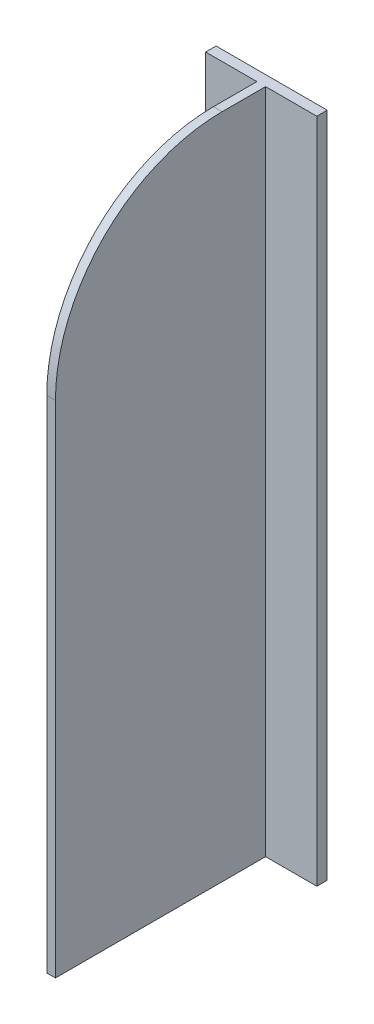
ISO-10303-21;
HEADER;
FILE_DESCRIPTION(('STEP AP214'),'2;1');
FILE_NAME('part.step','',(''),(''),'','','');
FILE_SCHEMA(('AUTOMOTIVE_DESIGN { 1 0 10303 214 1 1 1 1 }'));
ENDSEC;
DATA;
#1=APPLICATION_CONTEXT('core data for automotive mechanical design processes');
#2=APPLICATION_PROTOCOL_DEFINITION('international standard','automotive_design',2000,#1);
#3=PRODUCT_CONTEXT('',#1,'mechanical');
#4=PRODUCT('Part','Part','',(#3));
#5=PRODUCT_RELATED_PRODUCT_CATEGORY('part','',(#4));
#6=PRODUCT_DEFINITION_FORMATION('','',#4);
#7=PRODUCT_DEFINITION_CONTEXT('part definition',#1,'design');
#8=PRODUCT_DEFINITION('design','',#6,#7);
#9=PRODUCT_DEFINITION_SHAPE('','',#8);
#10=(LENGTH_UNIT() NAMED_UNIT(*) SI_UNIT(.MILLI.,.METRE.));
#11=(NAMED_UNIT(*) PLANE_ANGLE_UNIT() SI_UNIT($,.RADIAN.));
#12=(NAMED_UNIT(*) SI_UNIT($,.STERADIAN.) SOLID_ANGLE_UNIT());
#13=UNCERTAINTY_MEASURE_WITH_UNIT(LENGTH_MEASURE(1.E-05),#10,'distance_accuracy_value','');
#14=(GEOMETRIC_REPRESENTATION_CONTEXT(3) GLOBAL_UNCERTAINTY_ASSIGNED_CONTEXT((#13)) GLOBAL_UNIT_ASSIGNED_CONTEXT((#10,
#11,#12)) REPRESENTATION_CONTEXT('',''));
#15=CARTESIAN_POINT('',(0.,0.,0.));
#16=DIRECTION('',(0.,0.,1.));
#17=DIRECTION('',(1.,0.,0.));
#18=AXIS2_PLACEMENT_3D('',#15,#16,#17);
#19=CARTESIAN_POINT('',(50.8,304.8,9.525));
#20=DIRECTION('',(-1.,0.,0.));
#21=DIRECTION('',(0.,0.,1.));
#22=AXIS2_PLACEMENT_3D('',#19,#20,#21);
#23=PLANE('',#22);
#24=DIRECTION('',(0.,0.,-1.));
#25=VECTOR('',#24,1.);
#26=CARTESIAN_POINT('',(50.8,-304.8,9.525));
#27=LINE('',#26,#25);
#28=CARTESIAN_POINT('',(50.8,-304.8,9.525));
#29=VERTEX_POINT('',#28);
#30=CARTESIAN_POINT('',(50.8,-304.8,0.));
#31=VERTEX_POINT('',#30);
#32=EDGE_CURVE('E128',#29,#31,#27,.T.);
#33=ORIENTED_EDGE('',*,*,#32,.T.);
#34=DIRECTION('',(0.,-1.,0.));
#35=VECTOR('',#34,1.);
#36=CARTESIAN_POINT('',(50.8,304.8,0.));
#37=LINE('',#36,#35);
#38=CARTESIAN_POINT('',(50.8,304.8,0.));
#39=VERTEX_POINT('',#38);
#40=EDGE_CURVE('E108',#39,#31,#37,.T.);
#41=ORIENTED_EDGE('',*,*,#40,.F.);
#42=DIRECTION('',(0.,0.,-1.));
#43=VECTOR('',#42,1.);
#44=CARTESIAN_POINT('',(50.8,304.8,9.525));
#45=LINE('',#44,#43);
#46=CARTESIAN_POINT('',(50.8,304.8,9.525));
#47=VERTEX_POINT('',#46);
#48=EDGE_CURVE('E115',#47,#39,#45,.T.);
#49=ORIENTED_EDGE('',*,*,#48,.F.);
#50=DIRECTION('',(0.,-1.,0.));
#51=VECTOR('',#50,1.);
#52=CARTESIAN_POINT('',(50.8,304.8,9.525));
#53=LINE('',#52,#51);
#54=EDGE_CURVE('E149',#47,#29,#53,.T.);
#55=ORIENTED_EDGE('',*,*,#54,.T.);
#56=EDGE_LOOP('',(#33,#41,#49,#55));
#57=FACE_BOUND('',#56,.T.);
#58=ADVANCED_FACE('F35',(#57),#23,.F.);
#59=CARTESIAN_POINT('',(50.8,304.8,0.));
#60=DIRECTION('',(0.,0.,1.));
#61=DIRECTION('',(1.,0.,0.));
#62=AXIS2_PLACEMENT_3D('',#59,#60,#61);
#63=PLANE('',#62);
#64=DIRECTION('',(-1.,0.,0.));
#65=VECTOR('',#64,1.);
#66=CARTESIAN_POINT('',(50.8,-304.8,0.));
#67=LINE('',#66,#65);
#68=CARTESIAN_POINT('',(-50.8,-304.8,0.));
#69=VERTEX_POINT('',#68);
#70=EDGE_CURVE('E164',#31,#69,#67,.T.);
#71=ORIENTED_EDGE('',*,*,#70,.T.);
#72=DIRECTION('',(0.,-1.,0.));
#73=VECTOR('',#72,1.);
#74=CARTESIAN_POINT('',(-50.8,304.8,0.));
#75=LINE('',#74,#73);
#76=CARTESIAN_POINT('',(-50.8,304.8,0.));
#77=VERTEX_POINT('',#76);
#78=EDGE_CURVE('E111',#77,#69,#75,.T.);
#79=ORIENTED_EDGE('',*,*,#78,.F.);
#80=DIRECTION('',(-1.,0.,0.));
#81=VECTOR('',#80,1.);
#82=CARTESIAN_POINT('',(50.8,304.8,0.));
#83=LINE('',#82,#81);
#84=EDGE_CURVE('E104',#39,#77,#83,.T.);
#85=ORIENTED_EDGE('',*,*,#84,.F.);
#86=ORIENTED_EDGE('',*,*,#40,.T.);
#87=EDGE_LOOP('',(#71,#79,#85,#86));
#88=FACE_BOUND('',#87,.T.);
#89=ADVANCED_FACE('F106',(#88),#63,.F.);
#90=CARTESIAN_POINT('',(-50.8,304.8,0.));
#91=DIRECTION('',(1.,0.,0.));
#92=DIRECTION('',(0.,0.,-1.));
#93=AXIS2_PLACEMENT_3D('',#90,#91,#92);
#94=PLANE('',#93);
#95=DIRECTION('',(0.,0.,1.));
#96=VECTOR('',#95,1.);
#97=CARTESIAN_POINT('',(-50.8,-304.8,0.));
#98=LINE('',#97,#96);
#99=CARTESIAN_POINT('',(-50.8,-304.8,9.525));
#100=VERTEX_POINT('',#99);
#101=EDGE_CURVE('E162',#69,#100,#98,.T.);
#102=ORIENTED_EDGE('',*,*,#101,.T.);
#103=DIRECTION('',(0.,-1.,0.));
#104=VECTOR('',#103,1.);
#105=CARTESIAN_POINT('',(-50.8,304.8,9.525));
#106=LINE('',#105,#104);
#107=CARTESIAN_POINT('',(-50.8,304.8,9.525));
#108=VERTEX_POINT('',#107);
#109=EDGE_CURVE('E133',#108,#100,#106,.T.);
#110=ORIENTED_EDGE('',*,*,#109,.F.);
#111=DIRECTION('',(0.,0.,1.));
#112=VECTOR('',#111,1.);
#113=CARTESIAN_POINT('',(-50.8,304.8,0.));
#114=LINE('',#113,#112);
#115=EDGE_CURVE('E114',#77,#108,#114,.T.);
#116=ORIENTED_EDGE('',*,*,#115,.F.);
#117=ORIENTED_EDGE('',*,*,#78,.T.);
#118=EDGE_LOOP('',(#102,#110,#116,#117));
#119=FACE_BOUND('',#118,.T.);
#120=ADVANCED_FACE('F178',(#119),#94,.F.);
#121=CARTESIAN_POINT('',(-50.8,304.8,9.525));
#122=DIRECTION('',(0.,0.,-1.));
#123=DIRECTION('',(-1.,0.,0.));
#124=AXIS2_PLACEMENT_3D('',#121,#122,#123);
#125=PLANE('',#124);
#126=DIRECTION('',(1.,0.,0.));
#127=VECTOR('',#126,1.);
#128=CARTESIAN_POINT('',(-50.8,-304.8,9.525));
#129=LINE('',#128,#127);
#130=CARTESIAN_POINT('',(-3.96874999999999,-304.8,9.52500000000001));
#131=VERTEX_POINT('',#130);
#132=EDGE_CURVE('E160',#100,#131,#129,.T.);
#133=ORIENTED_EDGE('',*,*,#132,.T.);
#134=DIRECTION('',(0.,-1.,0.));
#135=VECTOR('',#134,1.);
#136=CARTESIAN_POINT('',(-3.96874999999999,304.8,9.52500000000001));
#137=LINE('',#136,#135);
#138=CARTESIAN_POINT('',(-3.96874999999999,304.8,9.52500000000001));
#139=VERTEX_POINT('',#138);
#140=EDGE_CURVE('E139',#139,#131,#137,.T.);
#141=ORIENTED_EDGE('',*,*,#140,.F.);
#142=DIRECTION('',(1.,0.,0.));
#143=VECTOR('',#142,1.);
#144=CARTESIAN_POINT('',(-50.8,304.8,9.525));
#145=LINE('',#144,#143);
#146=EDGE_CURVE('E172',#108,#139,#145,.T.);
#147=ORIENTED_EDGE('',*,*,#146,.F.);
#148=ORIENTED_EDGE('',*,*,#109,.T.);
#149=EDGE_LOOP('',(#133,#141,#147,#148));
#150=FACE_BOUND('',#149,.T.);
#151=ADVANCED_FACE('F182',(#150),#125,.F.);
#152=CARTESIAN_POINT('',(-3.96874999999999,304.8,9.52500000000001));
#153=DIRECTION('',(1.,0.,0.));
#154=DIRECTION('',(0.,0.,-1.));
#155=AXIS2_PLACEMENT_3D('',#152,#153,#154);
#156=PLANE('',#155);
#157=DIRECTION('',(0.,-1.,0.));
#158=VECTOR('',#157,1.);
#159=CARTESIAN_POINT('',(-3.96875,304.8,201.6125));
#160=LINE('',#159,#158);
#161=CARTESIAN_POINT('',(-3.96875,152.4,201.6125));
#162=VERTEX_POINT('',#161);
#163=CARTESIAN_POINT('',(-3.96875,-304.8,201.6125));
#164=VERTEX_POINT('',#163);
#165=EDGE_CURVE('E142',#162,#164,#160,.T.);
#166=ORIENTED_EDGE('',*,*,#165,.F.);
#167=CARTESIAN_POINT('',(-3.96874999999999,152.4,49.2125));
#168=DIRECTION('',(1.,0.,0.));
#169=DIRECTION('',(0.,0.,-1.));
#170=AXIS2_PLACEMENT_3D('',#167,#168,#169);
#171=CIRCLE('',#170,152.4);
#172=CARTESIAN_POINT('',(-3.96874999999999,304.8,49.2125));
#173=VERTEX_POINT('',#172);
#174=EDGE_CURVE('E11',#162,#173,#171,.F.);
#175=ORIENTED_EDGE('',*,*,#174,.T.);
#176=DIRECTION('',(0.,0.,1.));
#177=VECTOR('',#176,1.);
#178=CARTESIAN_POINT('',(-3.96874999999999,304.8,9.52500000000001));
#179=LINE('',#178,#177);
#180=EDGE_CURVE('E170',#139,#173,#179,.T.);
#181=ORIENTED_EDGE('',*,*,#180,.F.);
#182=ORIENTED_EDGE('',*,*,#140,.T.);
#183=DIRECTION('',(0.,0.,1.));
#184=VECTOR('',#183,1.);
#185=CARTESIAN_POINT('',(-3.96874999999999,-304.8,9.52500000000001));
#186=LINE('',#185,#184);
#187=EDGE_CURVE('E157',#131,#164,#186,.T.);
#188=ORIENTED_EDGE('',*,*,#187,.T.);
#189=EDGE_LOOP('',(#166,#175,#181,#182,#188));
#190=FACE_BOUND('',#189,.T.);
#191=ADVANCED_FACE('F186',(#190),#156,.F.);
#192=CARTESIAN_POINT('',(-3.96875,304.8,201.6125));
#193=DIRECTION('',(0.,0.,-1.));
#194=DIRECTION('',(-1.,0.,0.));
#195=AXIS2_PLACEMENT_3D('',#192,#193,#194);
#196=PLANE('',#195);
#197=DIRECTION('',(0.,-1.,0.));
#198=VECTOR('',#197,1.);
#199=CARTESIAN_POINT('',(3.96875,304.8,201.6125));
#200=LINE('',#199,#198);
#201=CARTESIAN_POINT('',(3.96875,152.4,201.6125));
#202=VERTEX_POINT('',#201);
#203=CARTESIAN_POINT('',(3.96875,-304.8,201.6125));
#204=VERTEX_POINT('',#203);
#205=EDGE_CURVE('E144',#202,#204,#200,.T.);
#206=ORIENTED_EDGE('',*,*,#205,.F.);
#207=DIRECTION('',(1.,0.,0.));
#208=VECTOR('',#207,1.);
#209=CARTESIAN_POINT('',(-3.96875,152.4,201.6125));
#210=LINE('',#209,#208);
#211=EDGE_CURVE('E43',#202,#162,#210,.F.);
#212=ORIENTED_EDGE('',*,*,#211,.T.);
#213=ORIENTED_EDGE('',*,*,#165,.T.);
#214=DIRECTION('',(1.,0.,0.));
#215=VECTOR('',#214,1.);
#216=CARTESIAN_POINT('',(-3.96875,-304.8,201.6125));
#217=LINE('',#216,#215);
#218=EDGE_CURVE('E154',#164,#204,#217,.T.);
#219=ORIENTED_EDGE('',*,*,#218,.T.);
#220=EDGE_LOOP('',(#206,#212,#213,#219));
#221=FACE_BOUND('',#220,.T.);
#222=ADVANCED_FACE('F209',(#221),#196,.F.);
#223=CARTESIAN_POINT('',(3.96875,304.8,201.6125));
#224=DIRECTION('',(-1.,0.,0.));
#225=DIRECTION('',(0.,0.,1.));
#226=AXIS2_PLACEMENT_3D('',#223,#224,#225);
#227=PLANE('',#226);
#228=DIRECTION('',(0.,0.,-1.));
#229=VECTOR('',#228,1.);
#230=CARTESIAN_POINT('',(3.96875,304.8,201.6125));
#231=LINE('',#230,#229);
#232=CARTESIAN_POINT('',(3.96874999999999,304.8,49.2125));
#233=VERTEX_POINT('',#232);
#234=CARTESIAN_POINT('',(3.96874999999999,304.8,9.52500000000001));
#235=VERTEX_POINT('',#234);
#236=EDGE_CURVE('E168',#233,#235,#231,.T.);
#237=ORIENTED_EDGE('',*,*,#236,.F.);
#238=CARTESIAN_POINT('',(3.96874999999999,152.4,49.2125));
#239=DIRECTION('',(-1.,0.,0.));
#240=DIRECTION('',(0.,0.,1.));
#241=AXIS2_PLACEMENT_3D('',#238,#239,#240);
#242=CIRCLE('',#241,152.4);
#243=EDGE_CURVE('E57',#233,#202,#242,.F.);
#244=ORIENTED_EDGE('',*,*,#243,.T.);
#245=ORIENTED_EDGE('',*,*,#205,.T.);
#246=DIRECTION('',(0.,0.,-1.));
#247=VECTOR('',#246,1.);
#248=CARTESIAN_POINT('',(3.96875,-304.8,201.6125));
#249=LINE('',#248,#247);
#250=CARTESIAN_POINT('',(3.96874999999999,-304.8,9.52500000000001));
#251=VERTEX_POINT('',#250);
#252=EDGE_CURVE('E152',#204,#251,#249,.T.);
#253=ORIENTED_EDGE('',*,*,#252,.T.);
#254=DIRECTION('',(0.,-1.,0.));
#255=VECTOR('',#254,1.);
#256=CARTESIAN_POINT('',(3.96874999999999,304.8,9.52500000000001));
#257=LINE('',#256,#255);
#258=EDGE_CURVE('E146',#235,#251,#257,.T.);
#259=ORIENTED_EDGE('',*,*,#258,.F.);
#260=EDGE_LOOP('',(#237,#244,#245,#253,#259));
#261=FACE_BOUND('',#260,.T.);
#262=ADVANCED_FACE('F212',(#261),#227,.F.);
#263=CARTESIAN_POINT('',(3.96874999999999,304.8,9.52500000000001));
#264=DIRECTION('',(0.,0.,-1.));
#265=DIRECTION('',(-1.,0.,0.));
#266=AXIS2_PLACEMENT_3D('',#263,#264,#265);
#267=PLANE('',#266);
#268=DIRECTION('',(1.,0.,0.));
#269=VECTOR('',#268,1.);
#270=CARTESIAN_POINT('',(3.96874999999999,-304.8,9.52500000000001));
#271=LINE('',#270,#269);
#272=EDGE_CURVE('E125',#251,#29,#271,.T.);
#273=ORIENTED_EDGE('',*,*,#272,.T.);
#274=ORIENTED_EDGE('',*,*,#54,.F.);
#275=DIRECTION('',(1.,0.,0.));
#276=VECTOR('',#275,1.);
#277=CARTESIAN_POINT('',(3.96874999999999,304.8,9.52500000000001));
#278=LINE('',#277,#276);
#279=EDGE_CURVE('E121',#235,#47,#278,.T.);
#280=ORIENTED_EDGE('',*,*,#279,.F.);
#281=ORIENTED_EDGE('',*,*,#258,.T.);
#282=EDGE_LOOP('',(#273,#274,#280,#281));
#283=FACE_BOUND('',#282,.T.);
#284=ADVANCED_FACE('F215',(#283),#267,.F.);
#285=CARTESIAN_POINT('',(0.,304.8,0.));
#286=DIRECTION('',(0.,1.,0.));
#287=DIRECTION('',(0.,0.,1.));
#288=AXIS2_PLACEMENT_3D('',#285,#286,#287);
#289=PLANE('',#288);
#290=ORIENTED_EDGE('',*,*,#180,.T.);
#291=DIRECTION('',(1.,0.,0.));
#292=VECTOR('',#291,1.);
#293=CARTESIAN_POINT('',(3.96875,304.8,49.2125));
#294=LINE('',#293,#292);
#295=EDGE_CURVE('E129',#173,#233,#294,.T.);
#296=ORIENTED_EDGE('',*,*,#295,.T.);
#297=ORIENTED_EDGE('',*,*,#236,.T.);
#298=ORIENTED_EDGE('',*,*,#279,.T.);
#299=ORIENTED_EDGE('',*,*,#48,.T.);
#300=ORIENTED_EDGE('',*,*,#84,.T.);
#301=ORIENTED_EDGE('',*,*,#115,.T.);
#302=ORIENTED_EDGE('',*,*,#146,.T.);
#303=EDGE_LOOP('',(#290,#296,#297,#298,#299,#300,#301,#302));
#304=FACE_BOUND('',#303,.T.);
#305=ADVANCED_FACE('F119',(#304),#289,.T.);
#306=CARTESIAN_POINT('',(0.,-304.8,0.));
#307=DIRECTION('',(0.,1.,0.));
#308=DIRECTION('',(0.,0.,1.));
#309=AXIS2_PLACEMENT_3D('',#306,#307,#308);
#310=PLANE('',#309);
#311=ORIENTED_EDGE('',*,*,#32,.F.);
#312=ORIENTED_EDGE('',*,*,#272,.F.);
#313=ORIENTED_EDGE('',*,*,#252,.F.);
#314=ORIENTED_EDGE('',*,*,#218,.F.);
#315=ORIENTED_EDGE('',*,*,#187,.F.);
#316=ORIENTED_EDGE('',*,*,#132,.F.);
#317=ORIENTED_EDGE('',*,*,#101,.F.);
#318=ORIENTED_EDGE('',*,*,#70,.F.);
#319=EDGE_LOOP('',(#311,#312,#313,#314,#315,#316,#317,#318));
#320=FACE_BOUND('',#319,.T.);
#321=ADVANCED_FACE('F191',(#320),#310,.F.);
#322=CARTESIAN_POINT('',(0.,152.4,49.2125));
#323=DIRECTION('',(-1.,0.,0.));
#324=DIRECTION('',(0.,0.,1.));
#325=AXIS2_PLACEMENT_3D('',#322,#323,#324);
#326=CYLINDRICAL_SURFACE('',#325,152.4);
#327=ORIENTED_EDGE('',*,*,#174,.F.);
#328=ORIENTED_EDGE('',*,*,#211,.F.);
#329=ORIENTED_EDGE('',*,*,#243,.F.);
#330=ORIENTED_EDGE('',*,*,#295,.F.);
#331=EDGE_LOOP('',(#327,#328,#329,#330));
#332=FACE_BOUND('',#331,.T.);
#333=ADVANCED_FACE('F37',(#332),#326,.T.);
#334=CLOSED_SHELL('',(#58,#89,#120,#151,#191,#222,#262,#284,#305,#321,#333));
#335=MANIFOLD_SOLID_BREP('B2',#334);
#336=ADVANCED_BREP_SHAPE_REPRESENTATION('',(#18,#335),#14);
#337=SHAPE_DEFINITION_REPRESENTATION(#9,#336);
ENDSEC;
END-ISO-10303-21;
